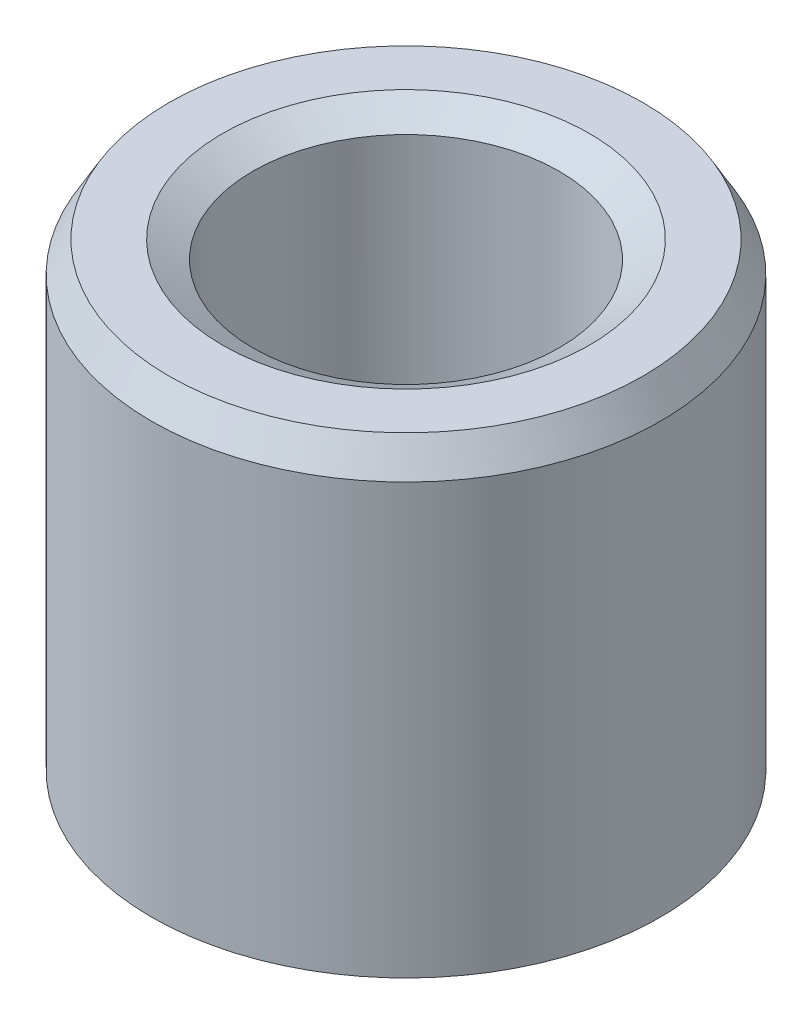
ISO-10303-21;
HEADER;
FILE_DESCRIPTION(('STEP AP214'),'2;1');
FILE_NAME('part.step','',(''),(''),'','','');
FILE_SCHEMA(('AUTOMOTIVE_DESIGN { 1 0 10303 214 1 1 1 1 }'));
ENDSEC;
DATA;
#1=APPLICATION_CONTEXT('core data for automotive mechanical design processes');
#2=APPLICATION_PROTOCOL_DEFINITION('international standard','automotive_design',2000,#1);
#3=PRODUCT_CONTEXT('',#1,'mechanical');
#4=PRODUCT('Part','Part','',(#3));
#5=PRODUCT_RELATED_PRODUCT_CATEGORY('part','',(#4));
#6=PRODUCT_DEFINITION_FORMATION('','',#4);
#7=PRODUCT_DEFINITION_CONTEXT('part definition',#1,'design');
#8=PRODUCT_DEFINITION('design','',#6,#7);
#9=PRODUCT_DEFINITION_SHAPE('','',#8);
#10=(LENGTH_UNIT() NAMED_UNIT(*) SI_UNIT(.MILLI.,.METRE.));
#11=(NAMED_UNIT(*) PLANE_ANGLE_UNIT() SI_UNIT($,.RADIAN.));
#12=(NAMED_UNIT(*) SI_UNIT($,.STERADIAN.) SOLID_ANGLE_UNIT());
#13=UNCERTAINTY_MEASURE_WITH_UNIT(LENGTH_MEASURE(1.E-05),#10,'distance_accuracy_value','');
#14=(GEOMETRIC_REPRESENTATION_CONTEXT(3) GLOBAL_UNCERTAINTY_ASSIGNED_CONTEXT((#13)) GLOBAL_UNIT_ASSIGNED_CONTEXT((#10,
#11,#12)) REPRESENTATION_CONTEXT('',''));
#15=CARTESIAN_POINT('',(0.,0.,0.));
#16=DIRECTION('',(0.,0.,1.));
#17=DIRECTION('',(1.,0.,0.));
#18=AXIS2_PLACEMENT_3D('',#15,#16,#17);
#19=CARTESIAN_POINT('',(0.,18.7586914291186,0.));
#20=DIRECTION('',(0.,-1.,0.));
#21=DIRECTION('',(0.,0.,-1.));
#22=AXIS2_PLACEMENT_3D('',#19,#20,#21);
#23=CYLINDRICAL_SURFACE('',#22,10.);
#24=CARTESIAN_POINT('',(0.,0.687731597818087,0.));
#25=DIRECTION('',(0.,1.,0.));
#26=DIRECTION('',(0.,0.,1.));
#27=AXIS2_PLACEMENT_3D('',#24,#25,#26);
#28=CIRCLE('',#27,10.);
#29=CARTESIAN_POINT('',(0.,0.687731597818087,-10.));
#30=VERTEX_POINT('',#29);
#31=EDGE_CURVE('E10',#30,#30,#28,.T.);
#32=CARTESIAN_POINT('',(0.,17.5675053597271,0.));
#33=DIRECTION('',(0.,1.,0.));
#34=DIRECTION('',(0.,0.,1.));
#35=AXIS2_PLACEMENT_3D('',#32,#33,#34);
#36=CIRCLE('',#35,10.);
#37=CARTESIAN_POINT('',(0.,17.5675053597271,-10.));
#38=VERTEX_POINT('',#37);
#39=EDGE_CURVE('E50',#38,#38,#36,.F.);
#40=CARTESIAN_POINT('',(0.,0.687731597818087,-10.));
#41=CARTESIAN_POINT('',(0.,0.86356257450464,-10.));
#42=CARTESIAN_POINT('',(0.,1.03939355119119,-10.));
#43=CARTESIAN_POINT('',(0.,1.3910555045643,-10.));
#44=CARTESIAN_POINT('',(0.,1.56688648125085,-10.));
#45=CARTESIAN_POINT('',(0.,1.91854843462395,-10.));
#46=CARTESIAN_POINT('',(0.,2.09437941131051,-10.));
#47=CARTESIAN_POINT('',(0.,2.44604136468361,-10.));
#48=CARTESIAN_POINT('',(0.,2.62187234137016,-10.));
#49=CARTESIAN_POINT('',(0.,2.97353429474327,-10.));
#50=CARTESIAN_POINT('',(0.,3.14936527142982,-10.));
#51=CARTESIAN_POINT('',(0.,3.50102722480292,-10.));
#52=CARTESIAN_POINT('',(0.,3.67685820148948,-10.));
#53=CARTESIAN_POINT('',(0.,4.02852015486258,-10.));
#54=CARTESIAN_POINT('',(0.,4.20435113154914,-10.));
#55=CARTESIAN_POINT('',(0.,4.55601308492224,-10.));
#56=CARTESIAN_POINT('',(0.,4.73184406160879,-10.));
#57=CARTESIAN_POINT('',(0.,5.0835060149819,-10.));
#58=CARTESIAN_POINT('',(0.,5.25933699166845,-10.));
#59=CARTESIAN_POINT('',(0.,5.61099894504155,-10.));
#60=CARTESIAN_POINT('',(0.,5.78682992172811,-10.));
#61=CARTESIAN_POINT('',(0.,6.13849187510121,-10.));
#62=CARTESIAN_POINT('',(0.,6.31432285178776,-10.));
#63=CARTESIAN_POINT('',(0.,6.66598480516087,-10.));
#64=CARTESIAN_POINT('',(0.,6.84181578184742,-10.));
#65=CARTESIAN_POINT('',(0.,7.19347773522053,-10.));
#66=CARTESIAN_POINT('',(0.,7.36930871190708,-10.));
#67=CARTESIAN_POINT('',(0.,7.72097066528018,-10.));
#68=CARTESIAN_POINT('',(0.,7.89680164196674,-10.));
#69=CARTESIAN_POINT('',(0.,8.24846359533984,-10.));
#70=CARTESIAN_POINT('',(0.,8.42429457202639,-10.));
#71=CARTESIAN_POINT('',(0.,8.7759565253995,-10.));
#72=CARTESIAN_POINT('',(0.,8.95178750208605,-10.));
#73=CARTESIAN_POINT('',(0.,9.30344945545916,-10.));
#74=CARTESIAN_POINT('',(0.,9.47928043214571,-10.));
#75=CARTESIAN_POINT('',(0.,9.83094238551881,-10.));
#76=CARTESIAN_POINT('',(0.,10.0067733622054,-10.));
#77=CARTESIAN_POINT('',(0.,10.3584353155785,-10.));
#78=CARTESIAN_POINT('',(0.,10.534266292265,-10.));
#79=CARTESIAN_POINT('',(0.,10.8859282456381,-10.));
#80=CARTESIAN_POINT('',(0.,11.0617592223247,-10.));
#81=CARTESIAN_POINT('',(0.,11.4134211756978,-10.));
#82=CARTESIAN_POINT('',(0.,11.5892521523843,-10.));
#83=CARTESIAN_POINT('',(0.,11.9409141057574,-10.));
#84=CARTESIAN_POINT('',(0.,12.116745082444,-10.));
#85=CARTESIAN_POINT('',(0.,12.4684070358171,-10.));
#86=CARTESIAN_POINT('',(0.,12.6442380125037,-10.));
#87=CARTESIAN_POINT('',(0.,12.9958999658768,-10.));
#88=CARTESIAN_POINT('',(0.,13.1717309425633,-10.));
#89=CARTESIAN_POINT('',(0.,13.5233928959364,-10.));
#90=CARTESIAN_POINT('',(0.,13.699223872623,-10.));
#91=CARTESIAN_POINT('',(0.,14.0508858259961,-10.));
#92=CARTESIAN_POINT('',(0.,14.2267168026826,-10.));
#93=CARTESIAN_POINT('',(0.,14.5783787560557,-10.));
#94=CARTESIAN_POINT('',(0.,14.7542097327423,-10.));
#95=CARTESIAN_POINT('',(0.,15.1058716861154,-10.));
#96=CARTESIAN_POINT('',(0.,15.2817026628019,-10.));
#97=CARTESIAN_POINT('',(0.,15.633364616175,-10.));
#98=CARTESIAN_POINT('',(0.,15.8091955928616,-10.));
#99=CARTESIAN_POINT('',(0.,16.1608575462347,-10.));
#100=CARTESIAN_POINT('',(0.,16.3366885229213,-10.));
#101=CARTESIAN_POINT('',(0.,16.6883504762944,-10.));
#102=CARTESIAN_POINT('',(0.,16.8641814529809,-10.));
#103=CARTESIAN_POINT('',(0.,17.215843406354,-10.));
#104=CARTESIAN_POINT('',(0.,17.3916743830406,-10.));
#105=CARTESIAN_POINT('',(0.,17.5675053597271,-10.));
#106=B_SPLINE_CURVE_WITH_KNOTS('',3,(#40,#41,#42,#43,#44,#45,#46,#47,#48,#49,#50,#51,#52,#53,
#54,#55,#56,#57,#58,#59,#60,#61,#62,#63,#64,#65,#66,#67,#68,#69,#70,#71,#72,#73,#74,#75,#76,#77,
#78,#79,#80,#81,#82,#83,#84,#85,#86,#87,#88,#89,#90,#91,#92,#93,#94,#95,#96,#97,#98,#99,#100,
#101,#102,#103,#104,#105),.UNSPECIFIED.,.F.,.F.,(4,2,2,2,2,2,2,2,2,2,2,2,2,2,2,2,2,2,2,2,2,2,2,
2,2,2,2,2,2,2,2,2,4),(0.,0.527492930059659,1.05498586011931,1.58247879017897,2.10997172023863,
2.63746465029828,3.16495758035794,3.6924505104176,4.21994344047726,4.74743637053691,
5.27492930059657,5.80242223065623,6.32991516071589,6.85740809077554,7.3849010208352,
7.91239395089486,8.43988688095452,8.96737981101417,9.49487274107383,10.0223656711335,
10.5498586011931,11.0773515312528,11.6048444613125,12.1323373913721,12.6598303214318,
13.1873232514914,13.7148161815511,14.2423091116107,14.7698020416704,15.2972949717301,
15.8247879017897,16.3522808318494,16.879773761909),.UNSPECIFIED.);
#107=EDGE_CURVE('BSEAM39',#30,#38,#106,.T.);
#108=ORIENTED_EDGE('',*,*,#31,.T.);
#109=ORIENTED_EDGE('',*,*,#39,.T.);
#110=ORIENTED_EDGE('',*,*,#107,.T.);
#111=ORIENTED_EDGE('',*,*,#107,.F.);
#112=EDGE_LOOP('',(#108,#110,#109,#111));
#113=FACE_BOUND('',#112,.T.);
#114=ADVANCED_FACE('F39',(#113),#23,.T.);
#115=CARTESIAN_POINT('',(0.,18.7586914291186,0.));
#116=DIRECTION('',(0.,1.,0.));
#117=DIRECTION('',(0.,0.,1.));
#118=AXIS2_PLACEMENT_3D('',#115,#116,#117);
#119=PLANE('',#118);
#120=CARTESIAN_POINT('',(0.,18.7586914291186,0.));
#121=DIRECTION('',(0.,1.,0.));
#122=DIRECTION('',(0.,0.,1.));
#123=AXIS2_PLACEMENT_3D('',#120,#121,#122);
#124=CIRCLE('',#123,7.20875912005489);
#125=CARTESIAN_POINT('',(0.,18.7586914291186,7.20875912005489));
#126=VERTEX_POINT('',#125);
#127=EDGE_CURVE('E58',#126,#126,#124,.F.);
#128=ORIENTED_EDGE('',*,*,#127,.T.);
#129=EDGE_LOOP('',(#128));
#130=FACE_BOUND('',#129,.T.);
#131=CARTESIAN_POINT('',(0.,18.7586914291186,0.));
#132=DIRECTION('',(0.,1.,0.));
#133=DIRECTION('',(0.,0.,1.));
#134=AXIS2_PLACEMENT_3D('',#131,#132,#133);
#135=CIRCLE('',#134,9.31226840218193);
#136=CARTESIAN_POINT('',(0.,18.7586914291186,9.31226840218193));
#137=VERTEX_POINT('',#136);
#138=EDGE_CURVE('E61',#137,#137,#135,.T.);
#139=ORIENTED_EDGE('',*,*,#138,.T.);
#140=EDGE_LOOP('',(#139));
#141=FACE_BOUND('',#140,.T.);
#142=ADVANCED_FACE('F88',(#130,#141),#119,.T.);
#143=CARTESIAN_POINT('',(0.,0.,0.));
#144=DIRECTION('',(0.,1.,0.));
#145=DIRECTION('',(0.,0.,1.));
#146=AXIS2_PLACEMENT_3D('',#143,#144,#145);
#147=PLANE('',#146);
#148=CARTESIAN_POINT('',(0.,0.,0.));
#149=DIRECTION('',(0.,1.,0.));
#150=DIRECTION('',(0.,0.,1.));
#151=AXIS2_PLACEMENT_3D('',#148,#149,#150);
#152=CIRCLE('',#151,6.7053046484815);
#153=CARTESIAN_POINT('',(0.,0.,6.7053046484815));
#154=VERTEX_POINT('',#153);
#155=EDGE_CURVE('E51',#154,#154,#152,.T.);
#156=ORIENTED_EDGE('',*,*,#155,.T.);
#157=EDGE_LOOP('',(#156));
#158=FACE_BOUND('',#157,.T.);
#159=CARTESIAN_POINT('',(0.,0.,0.));
#160=DIRECTION('',(0.,1.,0.));
#161=DIRECTION('',(0.,0.,1.));
#162=AXIS2_PLACEMENT_3D('',#159,#160,#161);
#163=CIRCLE('',#162,8.80881393060853);
#164=CARTESIAN_POINT('',(0.,0.,8.80881393060853));
#165=VERTEX_POINT('',#164);
#166=EDGE_CURVE('E54',#165,#165,#163,.F.);
#167=ORIENTED_EDGE('',*,*,#166,.T.);
#168=EDGE_LOOP('',(#167));
#169=FACE_BOUND('',#168,.T.);
#170=ADVANCED_FACE('F83',(#158,#169),#147,.F.);
#171=CARTESIAN_POINT('',(0.,18.7586914291186,0.));
#172=DIRECTION('',(0.,-1.,0.));
#173=DIRECTION('',(0.,0.,-1.));
#174=AXIS2_PLACEMENT_3D('',#171,#172,#173);
#175=CYLINDRICAL_SURFACE('',#174,6.01757305066342);
#176=CARTESIAN_POINT('',(0.,18.0709598313005,0.));
#177=DIRECTION('',(0.,1.,0.));
#178=DIRECTION('',(0.,0.,1.));
#179=AXIS2_PLACEMENT_3D('',#176,#177,#178);
#180=CIRCLE('',#179,6.01757305066342);
#181=CARTESIAN_POINT('',(0.,18.0709598313005,-6.01757305066342));
#182=VERTEX_POINT('',#181);
#183=EDGE_CURVE('E67',#182,#182,#180,.T.);
#184=CARTESIAN_POINT('',(0.,1.19118606939144,0.));
#185=DIRECTION('',(0.,1.,0.));
#186=DIRECTION('',(0.,0.,1.));
#187=AXIS2_PLACEMENT_3D('',#184,#185,#186);
#188=CIRCLE('',#187,6.01757305066342);
#189=CARTESIAN_POINT('',(0.,1.19118606939144,-6.01757305066342));
#190=VERTEX_POINT('',#189);
#191=EDGE_CURVE('E69',#190,#190,#188,.F.);
#192=CARTESIAN_POINT('',(0.,18.0709598313005,-6.01757305066342));
#193=CARTESIAN_POINT('',(0.,17.8951288546139,-6.01757305066342));
#194=CARTESIAN_POINT('',(0.,17.7192978779274,-6.01757305066342));
#195=CARTESIAN_POINT('',(0.,17.3676359245543,-6.01757305066342));
#196=CARTESIAN_POINT('',(0.,17.1918049478677,-6.01757305066342));
#197=CARTESIAN_POINT('',(0.,16.8401429944946,-6.01757305066342));
#198=CARTESIAN_POINT('',(0.,16.664312017808,-6.01757305066342));
#199=CARTESIAN_POINT('',(0.,16.3126500644349,-6.01757305066342));
#200=CARTESIAN_POINT('',(0.,16.1368190877484,-6.01757305066342));
#201=CARTESIAN_POINT('',(0.,15.7851571343753,-6.01757305066342));
#202=CARTESIAN_POINT('',(0.,15.6093261576887,-6.01757305066342));
#203=CARTESIAN_POINT('',(0.,15.2576642043156,-6.01757305066342));
#204=CARTESIAN_POINT('',(0.,15.0818332276291,-6.01757305066342));
#205=CARTESIAN_POINT('',(0.,14.730171274256,-6.01757305066342));
#206=CARTESIAN_POINT('',(0.,14.5543402975694,-6.01757305066342));
#207=CARTESIAN_POINT('',(0.,14.2026783441963,-6.01757305066342));
#208=CARTESIAN_POINT('',(0.,14.0268473675098,-6.01757305066342));
#209=CARTESIAN_POINT('',(0.,13.6751854141367,-6.01757305066342));
#210=CARTESIAN_POINT('',(0.,13.4993544374501,-6.01757305066342));
#211=CARTESIAN_POINT('',(0.,13.147692484077,-6.01757305066342));
#212=CARTESIAN_POINT('',(0.,12.9718615073904,-6.01757305066342));
#213=CARTESIAN_POINT('',(0.,12.6201995540173,-6.01757305066342));
#214=CARTESIAN_POINT('',(0.,12.4443685773308,-6.01757305066342));
#215=CARTESIAN_POINT('',(0.,12.0927066239577,-6.01757305066342));
#216=CARTESIAN_POINT('',(0.,11.9168756472711,-6.01757305066342));
#217=CARTESIAN_POINT('',(0.,11.565213693898,-6.01757305066342));
#218=CARTESIAN_POINT('',(0.,11.3893827172115,-6.01757305066342));
#219=CARTESIAN_POINT('',(0.,11.0377207638384,-6.01757305066342));
#220=CARTESIAN_POINT('',(0.,10.8618897871518,-6.01757305066342));
#221=CARTESIAN_POINT('',(0.,10.5102278337787,-6.01757305066342));
#222=CARTESIAN_POINT('',(0.,10.3343968570922,-6.01757305066342));
#223=CARTESIAN_POINT('',(0.,9.98273490371906,-6.01757305066342));
#224=CARTESIAN_POINT('',(0.,9.80690392703251,-6.01757305066342));
#225=CARTESIAN_POINT('',(0.,9.4552419736594,-6.01757305066342));
#226=CARTESIAN_POINT('',(0.,9.27941099697285,-6.01757305066342));
#227=CARTESIAN_POINT('',(0.,8.92774904359974,-6.01757305066342));
#228=CARTESIAN_POINT('',(0.,8.75191806691319,-6.01757305066342));
#229=CARTESIAN_POINT('',(0.,8.40025611354009,-6.01757305066342));
#230=CARTESIAN_POINT('',(0.,8.22442513685354,-6.01757305066342));
#231=CARTESIAN_POINT('',(0.,7.87276318348043,-6.01757305066342));
#232=CARTESIAN_POINT('',(0.,7.69693220679388,-6.01757305066342));
#233=CARTESIAN_POINT('',(0.,7.34527025342077,-6.01757305066342));
#234=CARTESIAN_POINT('',(0.,7.16943927673422,-6.01757305066342));
#235=CARTESIAN_POINT('',(0.,6.81777732336112,-6.01757305066342));
#236=CARTESIAN_POINT('',(0.,6.64194634667456,-6.01757305066342));
#237=CARTESIAN_POINT('',(0.,6.29028439330146,-6.01757305066342));
#238=CARTESIAN_POINT('',(0.,6.11445341661491,-6.01757305066342));
#239=CARTESIAN_POINT('',(0.,5.7627914632418,-6.01757305066342));
#240=CARTESIAN_POINT('',(0.,5.58696048655525,-6.01757305066342));
#241=CARTESIAN_POINT('',(0.,5.23529853318215,-6.01757305066342));
#242=CARTESIAN_POINT('',(0.,5.0594675564956,-6.01757305066342));
#243=CARTESIAN_POINT('',(0.,4.70780560312249,-6.01757305066342));
#244=CARTESIAN_POINT('',(0.,4.53197462643594,-6.01757305066342));
#245=CARTESIAN_POINT('',(0.,4.18031267306283,-6.01757305066342));
#246=CARTESIAN_POINT('',(0.,4.00448169637628,-6.01757305066342));
#247=CARTESIAN_POINT('',(0.,3.65281974300318,-6.01757305066342));
#248=CARTESIAN_POINT('',(0.,3.47698876631662,-6.01757305066342));
#249=CARTESIAN_POINT('',(0.,3.12532681294352,-6.01757305066342));
#250=CARTESIAN_POINT('',(0.,2.94949583625697,-6.01757305066342));
#251=CARTESIAN_POINT('',(0.,2.59783388288386,-6.01757305066342));
#252=CARTESIAN_POINT('',(0.,2.42200290619731,-6.01757305066342));
#253=CARTESIAN_POINT('',(0.,2.07034095282421,-6.01757305066342));
#254=CARTESIAN_POINT('',(0.,1.89450997613765,-6.01757305066342));
#255=CARTESIAN_POINT('',(0.,1.54284802276455,-6.01757305066342));
#256=CARTESIAN_POINT('',(0.,1.367017046078,-6.01757305066342));
#257=CARTESIAN_POINT('',(0.,1.19118606939144,-6.01757305066342));
#258=B_SPLINE_CURVE_WITH_KNOTS('',3,(#192,#193,#194,#195,#196,#197,#198,#199,#200,#201,#202,
#203,#204,#205,#206,#207,#208,#209,#210,#211,#212,#213,#214,#215,#216,#217,#218,#219,#220,#221,
#222,#223,#224,#225,#226,#227,#228,#229,#230,#231,#232,#233,#234,#235,#236,#237,#238,#239,#240,
#241,#242,#243,#244,#245,#246,#247,#248,#249,#250,#251,#252,#253,#254,#255,#256,#257),
.UNSPECIFIED.,.F.,.F.,(4,2,2,2,2,2,2,2,2,2,2,2,2,2,2,2,2,2,2,2,2,2,2,2,2,2,2,2,2,2,2,2,4),(0.,
0.527492930059655,1.05498586011931,1.58247879017897,2.10997172023862,2.63746465029828,
3.16495758035794,3.6924505104176,4.21994344047725,4.74743637053691,5.27492930059657,
5.80242223065622,6.32991516071588,6.85740809077554,7.38490102083519,7.91239395089485,
8.43988688095451,8.96737981101416,9.49487274107382,10.0223656711335,10.5498586011931,
11.0773515312528,11.6048444613124,12.1323373913721,12.6598303214318,13.1873232514914,
13.7148161815511,14.2423091116107,14.7698020416704,15.29729497173,15.8247879017897,
16.3522808318494,16.879773761909),.UNSPECIFIED.);
#259=EDGE_CURVE('BSEAM71',#182,#190,#258,.T.);
#260=ORIENTED_EDGE('',*,*,#183,.T.);
#261=ORIENTED_EDGE('',*,*,#191,.T.);
#262=ORIENTED_EDGE('',*,*,#259,.T.);
#263=ORIENTED_EDGE('',*,*,#259,.F.);
#264=EDGE_LOOP('',(#260,#262,#261,#263));
#265=FACE_BOUND('',#264,.T.);
#266=ADVANCED_FACE('F71',(#265),#175,.F.);
#267=CARTESIAN_POINT('',(0.,18.0709598313005,0.));
#268=DIRECTION('',(0.,1.,0.));
#269=DIRECTION('',(0.,0.,1.));
#270=AXIS2_PLACEMENT_3D('',#267,#268,#269);
#271=CONICAL_SURFACE('',#270,6.01757305066342,1.0471975511966);
#272=ORIENTED_EDGE('',*,*,#127,.F.);
#273=EDGE_LOOP('',(#272));
#274=FACE_BOUND('',#273,.T.);
#275=ORIENTED_EDGE('',*,*,#183,.F.);
#276=EDGE_LOOP('',(#275));
#277=FACE_BOUND('',#276,.T.);
#278=ADVANCED_FACE('F77',(#274,#277),#271,.F.);
#279=CARTESIAN_POINT('',(0.,0.,0.));
#280=DIRECTION('',(0.,-1.,0.));
#281=DIRECTION('',(0.,0.,-1.));
#282=AXIS2_PLACEMENT_3D('',#279,#280,#281);
#283=CONICAL_SURFACE('',#282,6.7053046484815,0.523598775598295);
#284=ORIENTED_EDGE('',*,*,#191,.F.);
#285=EDGE_LOOP('',(#284));
#286=FACE_BOUND('',#285,.T.);
#287=ORIENTED_EDGE('',*,*,#155,.F.);
#288=EDGE_LOOP('',(#287));
#289=FACE_BOUND('',#288,.T.);
#290=ADVANCED_FACE('F73',(#286,#289),#283,.F.);
#291=CARTESIAN_POINT('',(0.,0.687731597818087,0.));
#292=DIRECTION('',(0.,1.,0.));
#293=DIRECTION('',(0.,0.,1.));
#294=AXIS2_PLACEMENT_3D('',#291,#292,#293);
#295=CONICAL_SURFACE('',#294,10.,1.0471975511966);
#296=ORIENTED_EDGE('',*,*,#166,.F.);
#297=EDGE_LOOP('',(#296));
#298=FACE_BOUND('',#297,.T.);
#299=ORIENTED_EDGE('',*,*,#31,.F.);
#300=EDGE_LOOP('',(#299));
#301=FACE_BOUND('',#300,.T.);
#302=ADVANCED_FACE('F76',(#298,#301),#295,.T.);
#303=CARTESIAN_POINT('',(0.,18.7586914291186,0.));
#304=DIRECTION('',(0.,-1.,0.));
#305=DIRECTION('',(0.,0.,-1.));
#306=AXIS2_PLACEMENT_3D('',#303,#304,#305);
#307=CONICAL_SURFACE('',#306,9.31226840218193,0.523598775598298);
#308=ORIENTED_EDGE('',*,*,#39,.F.);
#309=EDGE_LOOP('',(#308));
#310=FACE_BOUND('',#309,.T.);
#311=ORIENTED_EDGE('',*,*,#138,.F.);
#312=EDGE_LOOP('',(#311));
#313=FACE_BOUND('',#312,.T.);
#314=ADVANCED_FACE('F45',(#310,#313),#307,.T.);
#315=CLOSED_SHELL('',(#114,#142,#170,#266,#278,#290,#302,#314));
#316=MANIFOLD_SOLID_BREP('B2',#315);
#317=ADVANCED_BREP_SHAPE_REPRESENTATION('',(#18,#316),#14);
#318=SHAPE_DEFINITION_REPRESENTATION(#9,#317);
ENDSEC;
END-ISO-10303-21;
